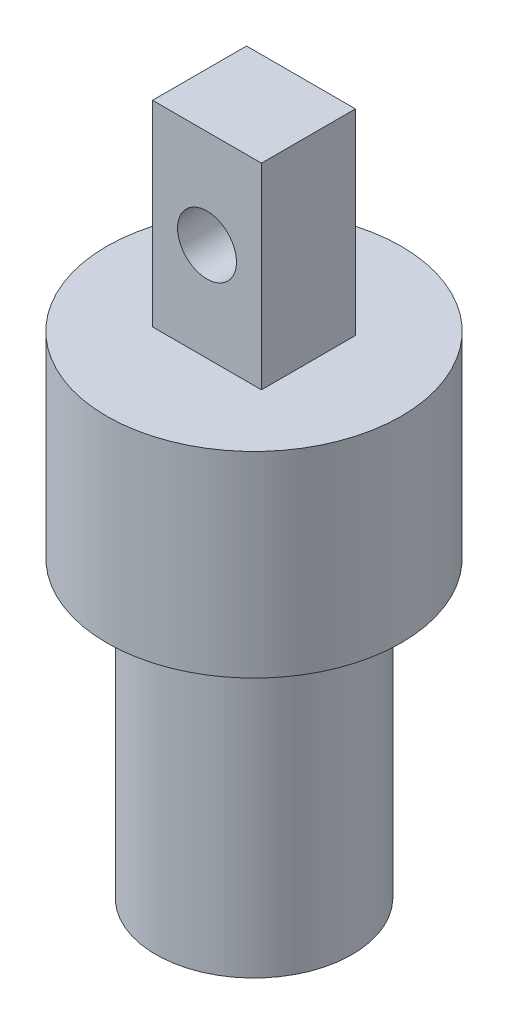
ISO-10303-21;
HEADER;
FILE_DESCRIPTION(('STEP AP214'),'2;1');
FILE_NAME('part.step','',(''),(''),'','','');
FILE_SCHEMA(('AUTOMOTIVE_DESIGN { 1 0 10303 214 1 1 1 1 }'));
ENDSEC;
DATA;
#1=APPLICATION_CONTEXT('core data for automotive mechanical design processes');
#2=APPLICATION_PROTOCOL_DEFINITION('international standard','automotive_design',2000,#1);
#3=PRODUCT_CONTEXT('',#1,'mechanical');
#4=PRODUCT('Part','Part','',(#3));
#5=PRODUCT_RELATED_PRODUCT_CATEGORY('part','',(#4));
#6=PRODUCT_DEFINITION_FORMATION('','',#4);
#7=PRODUCT_DEFINITION_CONTEXT('part definition',#1,'design');
#8=PRODUCT_DEFINITION('design','',#6,#7);
#9=PRODUCT_DEFINITION_SHAPE('','',#8);
#10=(LENGTH_UNIT() NAMED_UNIT(*) SI_UNIT(.MILLI.,.METRE.));
#11=(NAMED_UNIT(*) PLANE_ANGLE_UNIT() SI_UNIT($,.RADIAN.));
#12=(NAMED_UNIT(*) SI_UNIT($,.STERADIAN.) SOLID_ANGLE_UNIT());
#13=UNCERTAINTY_MEASURE_WITH_UNIT(LENGTH_MEASURE(1.E-05),#10,'distance_accuracy_value','');
#14=(GEOMETRIC_REPRESENTATION_CONTEXT(3) GLOBAL_UNCERTAINTY_ASSIGNED_CONTEXT((#13)) GLOBAL_UNIT_ASSIGNED_CONTEXT((#10,
#11,#12)) REPRESENTATION_CONTEXT('',''));
#15=CARTESIAN_POINT('',(0.,0.,0.));
#16=DIRECTION('',(0.,0.,1.));
#17=DIRECTION('',(1.,0.,0.));
#18=AXIS2_PLACEMENT_3D('',#15,#16,#17);
#19=CARTESIAN_POINT('',(0.,10.,0.));
#20=DIRECTION('',(0.,-1.,0.));
#21=DIRECTION('',(0.,0.,-1.));
#22=AXIS2_PLACEMENT_3D('',#19,#20,#21);
#23=CYLINDRICAL_SURFACE('',#22,7.5);
#24=CARTESIAN_POINT('',(0.,10.,0.));
#25=DIRECTION('',(0.,1.,0.));
#26=DIRECTION('',(0.,0.,1.));
#27=AXIS2_PLACEMENT_3D('',#24,#25,#26);
#28=CIRCLE('',#27,7.5);
#29=CARTESIAN_POINT('',(0.,10.,7.5));
#30=VERTEX_POINT('',#29);
#31=EDGE_CURVE('E47',#30,#30,#28,.T.);
#32=ORIENTED_EDGE('',*,*,#31,.F.);
#33=EDGE_LOOP('',(#32));
#34=FACE_BOUND('',#33,.T.);
#35=CARTESIAN_POINT('',(0.,0.,0.));
#36=DIRECTION('',(0.,1.,0.));
#37=DIRECTION('',(0.,0.,1.));
#38=AXIS2_PLACEMENT_3D('',#35,#36,#37);
#39=CIRCLE('',#38,7.5);
#40=CARTESIAN_POINT('',(0.,0.,7.5));
#41=VERTEX_POINT('',#40);
#42=EDGE_CURVE('E101',#41,#41,#39,.T.);
#43=ORIENTED_EDGE('',*,*,#42,.T.);
#44=EDGE_LOOP('',(#43));
#45=FACE_BOUND('',#44,.T.);
#46=ADVANCED_FACE('F39',(#34,#45),#23,.T.);
#47=CARTESIAN_POINT('',(0.,10.,0.));
#48=DIRECTION('',(0.,1.,0.));
#49=DIRECTION('',(0.,0.,1.));
#50=AXIS2_PLACEMENT_3D('',#47,#48,#49);
#51=PLANE('',#50);
#52=DIRECTION('',(0.,0.,-1.));
#53=VECTOR('',#52,1.);
#54=CARTESIAN_POINT('',(2.773663327815,10.,2.39410939874562));
#55=LINE('',#54,#53);
#56=CARTESIAN_POINT('',(2.773663327815,10.,2.39410939874562));
#57=VERTEX_POINT('',#56);
#58=CARTESIAN_POINT('',(2.773663327815,10.,-2.39410939874562));
#59=VERTEX_POINT('',#58);
#60=EDGE_CURVE('E55',#57,#59,#55,.T.);
#61=ORIENTED_EDGE('',*,*,#60,.F.);
#62=DIRECTION('',(1.,0.,0.));
#63=VECTOR('',#62,1.);
#64=CARTESIAN_POINT('',(-2.773663327815,10.,2.39410939874562));
#65=LINE('',#64,#63);
#66=CARTESIAN_POINT('',(-2.773663327815,10.,2.39410939874562));
#67=VERTEX_POINT('',#66);
#68=EDGE_CURVE('E59',#67,#57,#65,.T.);
#69=ORIENTED_EDGE('',*,*,#68,.F.);
#70=DIRECTION('',(0.,0.,1.));
#71=VECTOR('',#70,1.);
#72=CARTESIAN_POINT('',(-2.773663327815,10.,2.39410939874562));
#73=LINE('',#72,#71);
#74=CARTESIAN_POINT('',(-2.773663327815,10.,-2.39410939874562));
#75=VERTEX_POINT('',#74);
#76=EDGE_CURVE('E168',#75,#67,#73,.T.);
#77=ORIENTED_EDGE('',*,*,#76,.F.);
#78=DIRECTION('',(-1.,0.,0.));
#79=VECTOR('',#78,1.);
#80=CARTESIAN_POINT('',(-2.773663327815,10.,-2.39410939874562));
#81=LINE('',#80,#79);
#82=EDGE_CURVE('E166',#59,#75,#81,.T.);
#83=ORIENTED_EDGE('',*,*,#82,.F.);
#84=EDGE_LOOP('',(#61,#69,#77,#83));
#85=FACE_BOUND('',#84,.T.);
#86=ORIENTED_EDGE('',*,*,#31,.T.);
#87=EDGE_LOOP('',(#86));
#88=FACE_BOUND('',#87,.T.);
#89=ADVANCED_FACE('F111',(#85,#88),#51,.T.);
#90=CARTESIAN_POINT('',(0.,0.,0.));
#91=DIRECTION('',(0.,1.,0.));
#92=DIRECTION('',(0.,0.,1.));
#93=AXIS2_PLACEMENT_3D('',#90,#91,#92);
#94=PLANE('',#93);
#95=CARTESIAN_POINT('',(0.,0.,0.));
#96=DIRECTION('',(0.,-1.,0.));
#97=DIRECTION('',(0.,0.,-1.));
#98=AXIS2_PLACEMENT_3D('',#95,#96,#97);
#99=CIRCLE('',#98,5.);
#100=CARTESIAN_POINT('',(0.,0.,-5.));
#101=VERTEX_POINT('',#100);
#102=EDGE_CURVE('E11',#101,#101,#99,.T.);
#103=ORIENTED_EDGE('',*,*,#102,.F.);
#104=EDGE_LOOP('',(#103));
#105=FACE_BOUND('',#104,.T.);
#106=ORIENTED_EDGE('',*,*,#42,.F.);
#107=EDGE_LOOP('',(#106));
#108=FACE_BOUND('',#107,.T.);
#109=ADVANCED_FACE('F117',(#105,#108),#94,.F.);
#110=CARTESIAN_POINT('',(2.773663327815,20.,2.39410939874562));
#111=DIRECTION('',(-1.,0.,0.));
#112=DIRECTION('',(0.,0.,1.));
#113=AXIS2_PLACEMENT_3D('',#110,#111,#112);
#114=PLANE('',#113);
#115=ORIENTED_EDGE('',*,*,#60,.T.);
#116=DIRECTION('',(0.,-1.,0.));
#117=VECTOR('',#116,1.);
#118=CARTESIAN_POINT('',(2.773663327815,20.,-2.39410939874562));
#119=LINE('',#118,#117);
#120=CARTESIAN_POINT('',(2.773663327815,20.,-2.39410939874562));
#121=VERTEX_POINT('',#120);
#122=EDGE_CURVE('E84',#121,#59,#119,.T.);
#123=ORIENTED_EDGE('',*,*,#122,.F.);
#124=DIRECTION('',(0.,0.,-1.));
#125=VECTOR('',#124,1.);
#126=CARTESIAN_POINT('',(2.773663327815,20.,2.39410939874562));
#127=LINE('',#126,#125);
#128=CARTESIAN_POINT('',(2.773663327815,20.,2.39410939874562));
#129=VERTEX_POINT('',#128);
#130=EDGE_CURVE('E90',#129,#121,#127,.T.);
#131=ORIENTED_EDGE('',*,*,#130,.F.);
#132=DIRECTION('',(0.,-1.,0.));
#133=VECTOR('',#132,1.);
#134=CARTESIAN_POINT('',(2.773663327815,20.,2.39410939874562));
#135=LINE('',#134,#133);
#136=EDGE_CURVE('E164',#129,#57,#135,.T.);
#137=ORIENTED_EDGE('',*,*,#136,.T.);
#138=EDGE_LOOP('',(#115,#123,#131,#137));
#139=FACE_BOUND('',#138,.T.);
#140=ADVANCED_FACE('F100',(#139),#114,.F.);
#141=CARTESIAN_POINT('',(-2.773663327815,20.,-2.39410939874562));
#142=DIRECTION('',(0.,0.,1.));
#143=DIRECTION('',(1.,0.,0.));
#144=AXIS2_PLACEMENT_3D('',#141,#142,#143);
#145=PLANE('',#144);
#146=CARTESIAN_POINT('',(0.,15.,-2.39410939874562));
#147=DIRECTION('',(0.,0.,-1.));
#148=DIRECTION('',(-1.,0.,0.));
#149=AXIS2_PLACEMENT_3D('',#146,#147,#148);
#150=CIRCLE('',#149,1.5);
#151=CARTESIAN_POINT('',(-1.5,15.,-2.39410939874562));
#152=VERTEX_POINT('',#151);
#153=EDGE_CURVE('E157',#152,#152,#150,.T.);
#154=ORIENTED_EDGE('',*,*,#153,.F.);
#155=EDGE_LOOP('',(#154));
#156=FACE_BOUND('',#155,.T.);
#157=ORIENTED_EDGE('',*,*,#82,.T.);
#158=DIRECTION('',(0.,-1.,0.));
#159=VECTOR('',#158,1.);
#160=CARTESIAN_POINT('',(-2.773663327815,20.,-2.39410939874562));
#161=LINE('',#160,#159);
#162=CARTESIAN_POINT('',(-2.773663327815,20.,-2.39410939874562));
#163=VERTEX_POINT('',#162);
#164=EDGE_CURVE('E86',#163,#75,#161,.T.);
#165=ORIENTED_EDGE('',*,*,#164,.F.);
#166=DIRECTION('',(-1.,0.,0.));
#167=VECTOR('',#166,1.);
#168=CARTESIAN_POINT('',(-2.773663327815,20.,-2.39410939874562));
#169=LINE('',#168,#167);
#170=EDGE_CURVE('E79',#121,#163,#169,.T.);
#171=ORIENTED_EDGE('',*,*,#170,.F.);
#172=ORIENTED_EDGE('',*,*,#122,.T.);
#173=EDGE_LOOP('',(#157,#165,#171,#172));
#174=FACE_BOUND('',#173,.T.);
#175=ADVANCED_FACE('F82',(#156,#174),#145,.F.);
#176=CARTESIAN_POINT('',(-2.773663327815,20.,2.39410939874562));
#177=DIRECTION('',(1.,0.,0.));
#178=DIRECTION('',(0.,0.,-1.));
#179=AXIS2_PLACEMENT_3D('',#176,#177,#178);
#180=PLANE('',#179);
#181=ORIENTED_EDGE('',*,*,#76,.T.);
#182=DIRECTION('',(0.,-1.,0.));
#183=VECTOR('',#182,1.);
#184=CARTESIAN_POINT('',(-2.773663327815,20.,2.39410939874562));
#185=LINE('',#184,#183);
#186=CARTESIAN_POINT('',(-2.773663327815,20.,2.39410939874562));
#187=VERTEX_POINT('',#186);
#188=EDGE_CURVE('E104',#187,#67,#185,.T.);
#189=ORIENTED_EDGE('',*,*,#188,.F.);
#190=DIRECTION('',(0.,0.,1.));
#191=VECTOR('',#190,1.);
#192=CARTESIAN_POINT('',(-2.773663327815,20.,2.39410939874562));
#193=LINE('',#192,#191);
#194=EDGE_CURVE('E89',#163,#187,#193,.T.);
#195=ORIENTED_EDGE('',*,*,#194,.F.);
#196=ORIENTED_EDGE('',*,*,#164,.T.);
#197=EDGE_LOOP('',(#181,#189,#195,#196));
#198=FACE_BOUND('',#197,.T.);
#199=ADVANCED_FACE('F132',(#198),#180,.F.);
#200=CARTESIAN_POINT('',(-2.773663327815,20.,2.39410939874562));
#201=DIRECTION('',(0.,0.,-1.));
#202=DIRECTION('',(-1.,0.,0.));
#203=AXIS2_PLACEMENT_3D('',#200,#201,#202);
#204=PLANE('',#203);
#205=CARTESIAN_POINT('',(0.,15.,2.39410939874562));
#206=DIRECTION('',(0.,0.,-1.));
#207=DIRECTION('',(-1.,0.,0.));
#208=AXIS2_PLACEMENT_3D('',#205,#206,#207);
#209=CIRCLE('',#208,1.5);
#210=CARTESIAN_POINT('',(-1.5,15.,2.39410939874562));
#211=VERTEX_POINT('',#210);
#212=EDGE_CURVE('E42',#211,#211,#209,.T.);
#213=ORIENTED_EDGE('',*,*,#212,.T.);
#214=EDGE_LOOP('',(#213));
#215=FACE_BOUND('',#214,.T.);
#216=ORIENTED_EDGE('',*,*,#68,.T.);
#217=ORIENTED_EDGE('',*,*,#136,.F.);
#218=DIRECTION('',(1.,0.,0.));
#219=VECTOR('',#218,1.);
#220=CARTESIAN_POINT('',(-2.773663327815,20.,2.39410939874562));
#221=LINE('',#220,#219);
#222=EDGE_CURVE('E95',#187,#129,#221,.T.);
#223=ORIENTED_EDGE('',*,*,#222,.F.);
#224=ORIENTED_EDGE('',*,*,#188,.T.);
#225=EDGE_LOOP('',(#216,#217,#223,#224));
#226=FACE_BOUND('',#225,.T.);
#227=ADVANCED_FACE('F136',(#215,#226),#204,.F.);
#228=CARTESIAN_POINT('',(0.,20.,0.));
#229=DIRECTION('',(0.,-1.,0.));
#230=DIRECTION('',(0.,0.,-1.));
#231=AXIS2_PLACEMENT_3D('',#228,#229,#230);
#232=PLANE('',#231);
#233=ORIENTED_EDGE('',*,*,#130,.T.);
#234=ORIENTED_EDGE('',*,*,#170,.T.);
#235=ORIENTED_EDGE('',*,*,#194,.T.);
#236=ORIENTED_EDGE('',*,*,#222,.T.);
#237=EDGE_LOOP('',(#233,#234,#235,#236));
#238=FACE_BOUND('',#237,.T.);
#239=ADVANCED_FACE('F93',(#238),#232,.F.);
#240=CARTESIAN_POINT('',(0.,15.,7.60589060125439));
#241=DIRECTION('',(0.,0.,-1.));
#242=DIRECTION('',(-1.,0.,0.));
#243=AXIS2_PLACEMENT_3D('',#240,#241,#242);
#244=CYLINDRICAL_SURFACE('',#243,1.5);
#245=ORIENTED_EDGE('',*,*,#153,.T.);
#246=EDGE_LOOP('',(#245));
#247=FACE_BOUND('',#246,.T.);
#248=ORIENTED_EDGE('',*,*,#212,.F.);
#249=EDGE_LOOP('',(#248));
#250=FACE_BOUND('',#249,.T.);
#251=ADVANCED_FACE('F143',(#247,#250),#244,.F.);
#252=CARTESIAN_POINT('',(0.,-15.,0.));
#253=DIRECTION('',(0.,1.,0.));
#254=DIRECTION('',(0.,0.,1.));
#255=AXIS2_PLACEMENT_3D('',#252,#253,#254);
#256=CYLINDRICAL_SURFACE('',#255,5.);
#257=CARTESIAN_POINT('',(0.,-15.,0.));
#258=DIRECTION('',(0.,-1.,0.));
#259=DIRECTION('',(0.,0.,-1.));
#260=AXIS2_PLACEMENT_3D('',#257,#258,#259);
#261=CIRCLE('',#260,5.);
#262=CARTESIAN_POINT('',(0.,-15.,-5.));
#263=VERTEX_POINT('',#262);
#264=EDGE_CURVE('E156',#263,#263,#261,.T.);
#265=ORIENTED_EDGE('',*,*,#264,.F.);
#266=EDGE_LOOP('',(#265));
#267=FACE_BOUND('',#266,.T.);
#268=ORIENTED_EDGE('',*,*,#102,.T.);
#269=EDGE_LOOP('',(#268));
#270=FACE_BOUND('',#269,.T.);
#271=ADVANCED_FACE('F145',(#267,#270),#256,.T.);
#272=CARTESIAN_POINT('',(0.,-15.,0.));
#273=DIRECTION('',(0.,-1.,0.));
#274=DIRECTION('',(0.,0.,-1.));
#275=AXIS2_PLACEMENT_3D('',#272,#273,#274);
#276=PLANE('',#275);
#277=ORIENTED_EDGE('',*,*,#264,.T.);
#278=EDGE_LOOP('',(#277));
#279=FACE_BOUND('',#278,.T.);
#280=ADVANCED_FACE('F148',(#279),#276,.T.);
#281=CLOSED_SHELL('',(#46,#89,#109,#140,#175,#199,#227,#239,#251,#271,#280));
#282=MANIFOLD_SOLID_BREP('B2',#281);
#283=ADVANCED_BREP_SHAPE_REPRESENTATION('',(#18,#282),#14);
#284=SHAPE_DEFINITION_REPRESENTATION(#9,#283);
ENDSEC;
END-ISO-10303-21;
